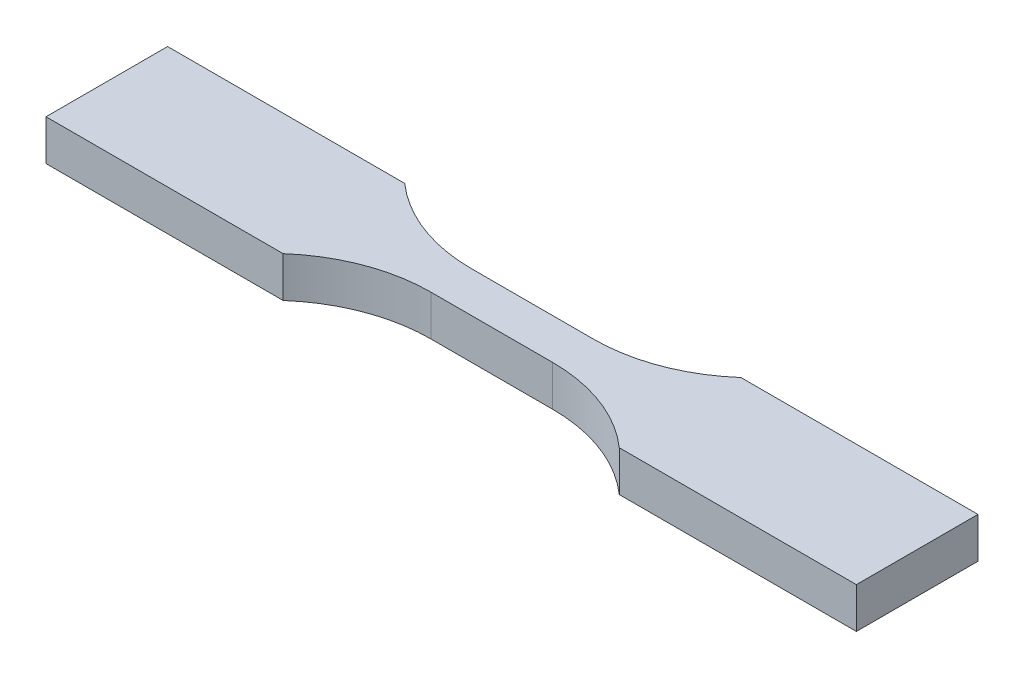
ISO-10303-21;
HEADER;
FILE_DESCRIPTION(('STEP AP214'),'2;1');
FILE_NAME('part.step','',(''),(''),'','','');
FILE_SCHEMA(('AUTOMOTIVE_DESIGN { 1 0 10303 214 1 1 1 1 }'));
ENDSEC;
DATA;
#1=APPLICATION_CONTEXT('core data for automotive mechanical design processes');
#2=APPLICATION_PROTOCOL_DEFINITION('international standard','automotive_design',2000,#1);
#3=PRODUCT_CONTEXT('',#1,'mechanical');
#4=PRODUCT('Part','Part','',(#3));
#5=PRODUCT_RELATED_PRODUCT_CATEGORY('part','',(#4));
#6=PRODUCT_DEFINITION_FORMATION('','',#4);
#7=PRODUCT_DEFINITION_CONTEXT('part definition',#1,'design');
#8=PRODUCT_DEFINITION('design','',#6,#7);
#9=PRODUCT_DEFINITION_SHAPE('','',#8);
#10=(LENGTH_UNIT() NAMED_UNIT(*) SI_UNIT(.MILLI.,.METRE.));
#11=(NAMED_UNIT(*) PLANE_ANGLE_UNIT() SI_UNIT($,.RADIAN.));
#12=(NAMED_UNIT(*) SI_UNIT($,.STERADIAN.) SOLID_ANGLE_UNIT());
#13=UNCERTAINTY_MEASURE_WITH_UNIT(LENGTH_MEASURE(1.E-05),#10,'distance_accuracy_value','');
#14=(GEOMETRIC_REPRESENTATION_CONTEXT(3) GLOBAL_UNCERTAINTY_ASSIGNED_CONTEXT((#13)) GLOBAL_UNIT_ASSIGNED_CONTEXT((#10,
#11,#12)) REPRESENTATION_CONTEXT('',''));
#15=CARTESIAN_POINT('',(0.,0.,0.));
#16=DIRECTION('',(0.,0.,1.));
#17=DIRECTION('',(1.,0.,0.));
#18=AXIS2_PLACEMENT_3D('',#15,#16,#17);
#19=CARTESIAN_POINT('',(-4.77447991768053,3.18,-14.2941784822917));
#20=DIRECTION('',(0.,-1.,0.));
#21=DIRECTION('',(0.,0.,-1.));
#22=AXIS2_PLACEMENT_3D('',#19,#20,#21);
#23=CYLINDRICAL_SURFACE('',#22,12.7);
#24=CARTESIAN_POINT('',(-4.77447991768053,0.,-14.2941784822917));
#25=DIRECTION('',(0.,-1.,0.));
#26=DIRECTION('',(0.,0.,-1.));
#27=AXIS2_PLACEMENT_3D('',#24,#25,#26);
#28=CIRCLE('',#27,12.7);
#29=CARTESIAN_POINT('',(-4.765,0.,-1.59418202043543));
#30=VERTEX_POINT('',#29);
#31=CARTESIAN_POINT('',(-13.17,0.,-4.765));
#32=VERTEX_POINT('',#31);
#33=EDGE_CURVE('E164',#30,#32,#28,.T.);
#34=ORIENTED_EDGE('',*,*,#33,.T.);
#35=DIRECTION('',(0.,-1.,0.));
#36=VECTOR('',#35,1.);
#37=CARTESIAN_POINT('',(-13.17,3.18,-4.765));
#38=LINE('',#37,#36);
#39=CARTESIAN_POINT('',(-13.17,3.18,-4.765));
#40=VERTEX_POINT('',#39);
#41=EDGE_CURVE('E11',#40,#32,#38,.T.);
#42=ORIENTED_EDGE('',*,*,#41,.F.);
#43=CARTESIAN_POINT('',(-4.77447991768053,3.18,-14.2941784822917));
#44=DIRECTION('',(0.,-1.,0.));
#45=DIRECTION('',(0.,0.,-1.));
#46=AXIS2_PLACEMENT_3D('',#43,#44,#45);
#47=CIRCLE('',#46,12.7);
#48=CARTESIAN_POINT('',(-4.765,3.18,-1.59418202043543));
#49=VERTEX_POINT('',#48);
#50=EDGE_CURVE('E198',#49,#40,#47,.T.);
#51=ORIENTED_EDGE('',*,*,#50,.F.);
#52=DIRECTION('',(0.,-1.,0.));
#53=VECTOR('',#52,1.);
#54=CARTESIAN_POINT('',(-4.765,3.18,-1.59418202043543));
#55=LINE('',#54,#53);
#56=EDGE_CURVE('E160',#49,#30,#55,.T.);
#57=ORIENTED_EDGE('',*,*,#56,.T.);
#58=EDGE_LOOP('',(#34,#42,#51,#57));
#59=FACE_BOUND('',#58,.T.);
#60=ADVANCED_FACE('F39',(#59),#23,.F.);
#61=CARTESIAN_POINT('',(-13.17,3.18,-4.765));
#62=DIRECTION('',(0.,0.,1.));
#63=DIRECTION('',(1.,0.,0.));
#64=AXIS2_PLACEMENT_3D('',#61,#62,#63);
#65=PLANE('',#64);
#66=DIRECTION('',(-1.,0.,0.));
#67=VECTOR('',#66,1.);
#68=CARTESIAN_POINT('',(-13.17,0.,-4.765));
#69=LINE('',#68,#67);
#70=CARTESIAN_POINT('',(-31.75,0.,-4.765));
#71=VERTEX_POINT('',#70);
#72=EDGE_CURVE('E168',#32,#71,#69,.T.);
#73=ORIENTED_EDGE('',*,*,#72,.T.);
#74=DIRECTION('',(0.,-1.,0.));
#75=VECTOR('',#74,1.);
#76=CARTESIAN_POINT('',(-31.75,3.18,-4.765));
#77=LINE('',#76,#75);
#78=CARTESIAN_POINT('',(-31.75,3.18,-4.765));
#79=VERTEX_POINT('',#78);
#80=EDGE_CURVE('E48',#79,#71,#77,.T.);
#81=ORIENTED_EDGE('',*,*,#80,.F.);
#82=DIRECTION('',(-1.,0.,0.));
#83=VECTOR('',#82,1.);
#84=CARTESIAN_POINT('',(-13.17,3.18,-4.765));
#85=LINE('',#84,#83);
#86=EDGE_CURVE('E111',#40,#79,#85,.T.);
#87=ORIENTED_EDGE('',*,*,#86,.F.);
#88=ORIENTED_EDGE('',*,*,#41,.T.);
#89=EDGE_LOOP('',(#73,#81,#87,#88));
#90=FACE_BOUND('',#89,.T.);
#91=ADVANCED_FACE('F292',(#90),#65,.F.);
#92=CARTESIAN_POINT('',(-31.75,3.18,-4.765));
#93=DIRECTION('',(1.,0.,0.));
#94=DIRECTION('',(0.,0.,-1.));
#95=AXIS2_PLACEMENT_3D('',#92,#93,#94);
#96=PLANE('',#95);
#97=DIRECTION('',(0.,0.,1.));
#98=VECTOR('',#97,1.);
#99=CARTESIAN_POINT('',(-31.75,0.,-4.765));
#100=LINE('',#99,#98);
#101=CARTESIAN_POINT('',(-31.75,0.,4.765));
#102=VERTEX_POINT('',#101);
#103=EDGE_CURVE('E171',#71,#102,#100,.T.);
#104=ORIENTED_EDGE('',*,*,#103,.T.);
#105=DIRECTION('',(0.,-1.,0.));
#106=VECTOR('',#105,1.);
#107=CARTESIAN_POINT('',(-31.75,3.18,4.765));
#108=LINE('',#107,#106);
#109=CARTESIAN_POINT('',(-31.75,3.18,4.765));
#110=VERTEX_POINT('',#109);
#111=EDGE_CURVE('E225',#110,#102,#108,.T.);
#112=ORIENTED_EDGE('',*,*,#111,.F.);
#113=DIRECTION('',(0.,0.,1.));
#114=VECTOR('',#113,1.);
#115=CARTESIAN_POINT('',(-31.75,3.18,-4.765));
#116=LINE('',#115,#114);
#117=EDGE_CURVE('E235',#79,#110,#116,.T.);
#118=ORIENTED_EDGE('',*,*,#117,.F.);
#119=ORIENTED_EDGE('',*,*,#80,.T.);
#120=EDGE_LOOP('',(#104,#112,#118,#119));
#121=FACE_BOUND('',#120,.T.);
#122=ADVANCED_FACE('F233',(#121),#96,.F.);
#123=CARTESIAN_POINT('',(-31.75,3.18,4.765));
#124=DIRECTION('',(0.,0.,-1.));
#125=DIRECTION('',(-1.,0.,0.));
#126=AXIS2_PLACEMENT_3D('',#123,#124,#125);
#127=PLANE('',#126);
#128=DIRECTION('',(1.,0.,0.));
#129=VECTOR('',#128,1.);
#130=CARTESIAN_POINT('',(-31.75,0.,4.765));
#131=LINE('',#130,#129);
#132=CARTESIAN_POINT('',(-13.17,0.,4.765));
#133=VERTEX_POINT('',#132);
#134=EDGE_CURVE('E174',#102,#133,#131,.T.);
#135=ORIENTED_EDGE('',*,*,#134,.T.);
#136=DIRECTION('',(0.,-1.,0.));
#137=VECTOR('',#136,1.);
#138=CARTESIAN_POINT('',(-13.17,3.18,4.765));
#139=LINE('',#138,#137);
#140=CARTESIAN_POINT('',(-13.17,3.18,4.765));
#141=VERTEX_POINT('',#140);
#142=EDGE_CURVE('E221',#141,#133,#139,.T.);
#143=ORIENTED_EDGE('',*,*,#142,.F.);
#144=DIRECTION('',(1.,0.,0.));
#145=VECTOR('',#144,1.);
#146=CARTESIAN_POINT('',(-31.75,3.18,4.765));
#147=LINE('',#146,#145);
#148=EDGE_CURVE('E254',#110,#141,#147,.T.);
#149=ORIENTED_EDGE('',*,*,#148,.F.);
#150=ORIENTED_EDGE('',*,*,#111,.T.);
#151=EDGE_LOOP('',(#135,#143,#149,#150));
#152=FACE_BOUND('',#151,.T.);
#153=ADVANCED_FACE('F244',(#152),#127,.F.);
#154=CARTESIAN_POINT('',(-4.765,3.18,14.2858179795646));
#155=DIRECTION('',(0.,-1.,0.));
#156=DIRECTION('',(0.,0.,-1.));
#157=AXIS2_PLACEMENT_3D('',#154,#155,#156);
#158=CYLINDRICAL_SURFACE('',#157,12.7);
#159=CARTESIAN_POINT('',(-4.765,0.,14.2858179795646));
#160=DIRECTION('',(0.,-1.,0.));
#161=DIRECTION('',(0.,0.,1.));
#162=AXIS2_PLACEMENT_3D('',#159,#160,#161);
#163=CIRCLE('',#162,12.7);
#164=CARTESIAN_POINT('',(-4.765,0.,1.58581797956457));
#165=VERTEX_POINT('',#164);
#166=EDGE_CURVE('E177',#133,#165,#163,.T.);
#167=ORIENTED_EDGE('',*,*,#166,.T.);
#168=DIRECTION('',(0.,-1.,0.));
#169=VECTOR('',#168,1.);
#170=CARTESIAN_POINT('',(-4.765,3.18,1.58581797956457));
#171=LINE('',#170,#169);
#172=CARTESIAN_POINT('',(-4.765,3.18,1.58581797956457));
#173=VERTEX_POINT('',#172);
#174=EDGE_CURVE('E217',#173,#165,#171,.T.);
#175=ORIENTED_EDGE('',*,*,#174,.F.);
#176=CARTESIAN_POINT('',(-4.765,3.18,14.2858179795646));
#177=DIRECTION('',(0.,-1.,0.));
#178=DIRECTION('',(0.,0.,1.));
#179=AXIS2_PLACEMENT_3D('',#176,#177,#178);
#180=CIRCLE('',#179,12.7);
#181=EDGE_CURVE('E250',#141,#173,#180,.T.);
#182=ORIENTED_EDGE('',*,*,#181,.F.);
#183=ORIENTED_EDGE('',*,*,#142,.T.);
#184=EDGE_LOOP('',(#167,#175,#182,#183));
#185=FACE_BOUND('',#184,.T.);
#186=ADVANCED_FACE('F248',(#185),#158,.F.);
#187=CARTESIAN_POINT('',(-4.765,3.18,1.58581797956457));
#188=DIRECTION('',(0.,0.,-1.));
#189=DIRECTION('',(-1.,0.,0.));
#190=AXIS2_PLACEMENT_3D('',#187,#188,#189);
#191=PLANE('',#190);
#192=DIRECTION('',(1.,0.,0.));
#193=VECTOR('',#192,1.);
#194=CARTESIAN_POINT('',(-4.765,0.,1.58581797956457));
#195=LINE('',#194,#193);
#196=CARTESIAN_POINT('',(4.765,0.,1.58581797956457));
#197=VERTEX_POINT('',#196);
#198=EDGE_CURVE('E180',#165,#197,#195,.T.);
#199=ORIENTED_EDGE('',*,*,#198,.T.);
#200=DIRECTION('',(0.,-1.,0.));
#201=VECTOR('',#200,1.);
#202=CARTESIAN_POINT('',(4.765,3.18,1.58581797956457));
#203=LINE('',#202,#201);
#204=CARTESIAN_POINT('',(4.765,3.18,1.58581797956457));
#205=VERTEX_POINT('',#204);
#206=EDGE_CURVE('E213',#205,#197,#203,.T.);
#207=ORIENTED_EDGE('',*,*,#206,.F.);
#208=DIRECTION('',(1.,0.,0.));
#209=VECTOR('',#208,1.);
#210=CARTESIAN_POINT('',(-4.765,3.18,1.58581797956457));
#211=LINE('',#210,#209);
#212=EDGE_CURVE('E253',#173,#205,#211,.T.);
#213=ORIENTED_EDGE('',*,*,#212,.F.);
#214=ORIENTED_EDGE('',*,*,#174,.T.);
#215=EDGE_LOOP('',(#199,#207,#213,#214));
#216=FACE_BOUND('',#215,.T.);
#217=ADVANCED_FACE('F305',(#216),#191,.F.);
#218=CARTESIAN_POINT('',(4.765,3.18,14.2858179795646));
#219=DIRECTION('',(0.,-1.,0.));
#220=DIRECTION('',(0.,0.,-1.));
#221=AXIS2_PLACEMENT_3D('',#218,#219,#220);
#222=CYLINDRICAL_SURFACE('',#221,12.7);
#223=CARTESIAN_POINT('',(4.765,0.,14.2858179795646));
#224=DIRECTION('',(0.,-1.,0.));
#225=DIRECTION('',(0.,0.,-1.));
#226=AXIS2_PLACEMENT_3D('',#223,#224,#225);
#227=CIRCLE('',#226,12.7);
#228=CARTESIAN_POINT('',(13.17,0.,4.765));
#229=VERTEX_POINT('',#228);
#230=EDGE_CURVE('E183',#197,#229,#227,.T.);
#231=ORIENTED_EDGE('',*,*,#230,.T.);
#232=DIRECTION('',(0.,-1.,0.));
#233=VECTOR('',#232,1.);
#234=CARTESIAN_POINT('',(13.17,3.18,4.765));
#235=LINE('',#234,#233);
#236=CARTESIAN_POINT('',(13.17,3.18,4.765));
#237=VERTEX_POINT('',#236);
#238=EDGE_CURVE('E209',#237,#229,#235,.T.);
#239=ORIENTED_EDGE('',*,*,#238,.F.);
#240=CARTESIAN_POINT('',(4.765,3.18,14.2858179795646));
#241=DIRECTION('',(0.,-1.,0.));
#242=DIRECTION('',(0.,0.,-1.));
#243=AXIS2_PLACEMENT_3D('',#240,#241,#242);
#244=CIRCLE('',#243,12.7);
#245=EDGE_CURVE('E258',#205,#237,#244,.T.);
#246=ORIENTED_EDGE('',*,*,#245,.F.);
#247=ORIENTED_EDGE('',*,*,#206,.T.);
#248=EDGE_LOOP('',(#231,#239,#246,#247));
#249=FACE_BOUND('',#248,.T.);
#250=ADVANCED_FACE('F308',(#249),#222,.F.);
#251=CARTESIAN_POINT('',(31.75,3.18,4.765));
#252=DIRECTION('',(0.,0.,-1.));
#253=DIRECTION('',(-1.,0.,0.));
#254=AXIS2_PLACEMENT_3D('',#251,#252,#253);
#255=PLANE('',#254);
#256=DIRECTION('',(1.,0.,0.));
#257=VECTOR('',#256,1.);
#258=CARTESIAN_POINT('',(31.75,0.,4.765));
#259=LINE('',#258,#257);
#260=CARTESIAN_POINT('',(31.75,0.,4.765));
#261=VERTEX_POINT('',#260);
#262=EDGE_CURVE('E186',#229,#261,#259,.T.);
#263=ORIENTED_EDGE('',*,*,#262,.T.);
#264=DIRECTION('',(0.,-1.,0.));
#265=VECTOR('',#264,1.);
#266=CARTESIAN_POINT('',(31.75,3.18,4.765));
#267=LINE('',#266,#265);
#268=CARTESIAN_POINT('',(31.75,3.18,4.765));
#269=VERTEX_POINT('',#268);
#270=EDGE_CURVE('E205',#269,#261,#267,.T.);
#271=ORIENTED_EDGE('',*,*,#270,.F.);
#272=DIRECTION('',(1.,0.,0.));
#273=VECTOR('',#272,1.);
#274=CARTESIAN_POINT('',(31.75,3.18,4.765));
#275=LINE('',#274,#273);
#276=EDGE_CURVE('E265',#237,#269,#275,.T.);
#277=ORIENTED_EDGE('',*,*,#276,.F.);
#278=ORIENTED_EDGE('',*,*,#238,.T.);
#279=EDGE_LOOP('',(#263,#271,#277,#278));
#280=FACE_BOUND('',#279,.T.);
#281=ADVANCED_FACE('F273',(#280),#255,.F.);
#282=CARTESIAN_POINT('',(31.75,3.18,-4.765));
#283=DIRECTION('',(-1.,0.,0.));
#284=DIRECTION('',(0.,0.,1.));
#285=AXIS2_PLACEMENT_3D('',#282,#283,#284);
#286=PLANE('',#285);
#287=DIRECTION('',(0.,0.,-1.));
#288=VECTOR('',#287,1.);
#289=CARTESIAN_POINT('',(31.75,0.,-4.765));
#290=LINE('',#289,#288);
#291=CARTESIAN_POINT('',(31.75,0.,-4.765));
#292=VERTEX_POINT('',#291);
#293=EDGE_CURVE('E189',#261,#292,#290,.T.);
#294=ORIENTED_EDGE('',*,*,#293,.T.);
#295=DIRECTION('',(0.,-1.,0.));
#296=VECTOR('',#295,1.);
#297=CARTESIAN_POINT('',(31.75,3.18,-4.765));
#298=LINE('',#297,#296);
#299=CARTESIAN_POINT('',(31.75,3.18,-4.765));
#300=VERTEX_POINT('',#299);
#301=EDGE_CURVE('E153',#300,#292,#298,.T.);
#302=ORIENTED_EDGE('',*,*,#301,.F.);
#303=DIRECTION('',(0.,0.,-1.));
#304=VECTOR('',#303,1.);
#305=CARTESIAN_POINT('',(31.75,3.18,-4.765));
#306=LINE('',#305,#304);
#307=EDGE_CURVE('E142',#269,#300,#306,.T.);
#308=ORIENTED_EDGE('',*,*,#307,.F.);
#309=ORIENTED_EDGE('',*,*,#270,.T.);
#310=EDGE_LOOP('',(#294,#302,#308,#309));
#311=FACE_BOUND('',#310,.T.);
#312=ADVANCED_FACE('F277',(#311),#286,.F.);
#313=CARTESIAN_POINT('',(13.17,3.18,-4.765));
#314=DIRECTION('',(0.,0.,1.));
#315=DIRECTION('',(1.,0.,0.));
#316=AXIS2_PLACEMENT_3D('',#313,#314,#315);
#317=PLANE('',#316);
#318=DIRECTION('',(-1.,0.,0.));
#319=VECTOR('',#318,1.);
#320=CARTESIAN_POINT('',(13.17,0.,-4.765));
#321=LINE('',#320,#319);
#322=CARTESIAN_POINT('',(13.17,0.,-4.765));
#323=VERTEX_POINT('',#322);
#324=EDGE_CURVE('E151',#292,#323,#321,.T.);
#325=ORIENTED_EDGE('',*,*,#324,.T.);
#326=DIRECTION('',(0.,-1.,0.));
#327=VECTOR('',#326,1.);
#328=CARTESIAN_POINT('',(13.17,3.18,-4.765));
#329=LINE('',#328,#327);
#330=CARTESIAN_POINT('',(13.17,3.18,-4.765));
#331=VERTEX_POINT('',#330);
#332=EDGE_CURVE('E148',#331,#323,#329,.T.);
#333=ORIENTED_EDGE('',*,*,#332,.F.);
#334=DIRECTION('',(-1.,0.,0.));
#335=VECTOR('',#334,1.);
#336=CARTESIAN_POINT('',(13.17,3.18,-4.765));
#337=LINE('',#336,#335);
#338=EDGE_CURVE('E136',#300,#331,#337,.T.);
#339=ORIENTED_EDGE('',*,*,#338,.F.);
#340=ORIENTED_EDGE('',*,*,#301,.T.);
#341=EDGE_LOOP('',(#325,#333,#339,#340));
#342=FACE_BOUND('',#341,.T.);
#343=ADVANCED_FACE('F149',(#342),#317,.F.);
#344=CARTESIAN_POINT('',(4.77447991768053,3.18,-14.2941784822917));
#345=DIRECTION('',(0.,-1.,0.));
#346=DIRECTION('',(0.,0.,-1.));
#347=AXIS2_PLACEMENT_3D('',#344,#345,#346);
#348=CYLINDRICAL_SURFACE('',#347,12.7);
#349=CARTESIAN_POINT('',(4.77447991768053,0.,-14.2941784822917));
#350=DIRECTION('',(0.,-1.,0.));
#351=DIRECTION('',(0.,0.,1.));
#352=AXIS2_PLACEMENT_3D('',#349,#350,#351);
#353=CIRCLE('',#352,12.7);
#354=CARTESIAN_POINT('',(4.765,0.,-1.59418202043543));
#355=VERTEX_POINT('',#354);
#356=EDGE_CURVE('E97',#323,#355,#353,.T.);
#357=ORIENTED_EDGE('',*,*,#356,.T.);
#358=DIRECTION('',(0.,-1.,0.));
#359=VECTOR('',#358,1.);
#360=CARTESIAN_POINT('',(4.765,3.18,-1.59418202043543));
#361=LINE('',#360,#359);
#362=CARTESIAN_POINT('',(4.765,3.18,-1.59418202043543));
#363=VERTEX_POINT('',#362);
#364=EDGE_CURVE('E154',#363,#355,#361,.T.);
#365=ORIENTED_EDGE('',*,*,#364,.F.);
#366=CARTESIAN_POINT('',(4.77447991768053,3.18,-14.2941784822917));
#367=DIRECTION('',(0.,-1.,0.));
#368=DIRECTION('',(0.,0.,1.));
#369=AXIS2_PLACEMENT_3D('',#366,#367,#368);
#370=CIRCLE('',#369,12.7);
#371=EDGE_CURVE('E140',#331,#363,#370,.T.);
#372=ORIENTED_EDGE('',*,*,#371,.F.);
#373=ORIENTED_EDGE('',*,*,#332,.T.);
#374=EDGE_LOOP('',(#357,#365,#372,#373));
#375=FACE_BOUND('',#374,.T.);
#376=ADVANCED_FACE('F156',(#375),#348,.F.);
#377=CARTESIAN_POINT('',(-4.765,3.18,-1.59418202043543));
#378=DIRECTION('',(0.,0.,1.));
#379=DIRECTION('',(1.,0.,0.));
#380=AXIS2_PLACEMENT_3D('',#377,#378,#379);
#381=PLANE('',#380);
#382=DIRECTION('',(-1.,0.,0.));
#383=VECTOR('',#382,1.);
#384=CARTESIAN_POINT('',(-4.765,0.,-1.59418202043543));
#385=LINE('',#384,#383);
#386=EDGE_CURVE('E103',#355,#30,#385,.T.);
#387=ORIENTED_EDGE('',*,*,#386,.T.);
#388=ORIENTED_EDGE('',*,*,#56,.F.);
#389=DIRECTION('',(-1.,0.,0.));
#390=VECTOR('',#389,1.);
#391=CARTESIAN_POINT('',(-4.765,3.18,-1.59418202043543));
#392=LINE('',#391,#390);
#393=EDGE_CURVE('E56',#363,#49,#392,.T.);
#394=ORIENTED_EDGE('',*,*,#393,.F.);
#395=ORIENTED_EDGE('',*,*,#364,.T.);
#396=EDGE_LOOP('',(#387,#388,#394,#395));
#397=FACE_BOUND('',#396,.T.);
#398=ADVANCED_FACE('F281',(#397),#381,.F.);
#399=CARTESIAN_POINT('',(-4.77447991768053,3.18,-14.2941784822917));
#400=DIRECTION('',(0.,-1.,0.));
#401=DIRECTION('',(0.,0.,-1.));
#402=AXIS2_PLACEMENT_3D('',#399,#400,#401);
#403=PLANE('',#402);
#404=ORIENTED_EDGE('',*,*,#50,.T.);
#405=ORIENTED_EDGE('',*,*,#86,.T.);
#406=ORIENTED_EDGE('',*,*,#117,.T.);
#407=ORIENTED_EDGE('',*,*,#148,.T.);
#408=ORIENTED_EDGE('',*,*,#181,.T.);
#409=ORIENTED_EDGE('',*,*,#212,.T.);
#410=ORIENTED_EDGE('',*,*,#245,.T.);
#411=ORIENTED_EDGE('',*,*,#276,.T.);
#412=ORIENTED_EDGE('',*,*,#307,.T.);
#413=ORIENTED_EDGE('',*,*,#338,.T.);
#414=ORIENTED_EDGE('',*,*,#371,.T.);
#415=ORIENTED_EDGE('',*,*,#393,.T.);
#416=EDGE_LOOP('',(#404,#405,#406,#407,#408,#409,#410,#411,#412,#413,#414,#415));
#417=FACE_BOUND('',#416,.T.);
#418=ADVANCED_FACE('F138',(#417),#403,.F.);
#419=CARTESIAN_POINT('',(-4.77447991768053,0.,-14.2941784822917));
#420=DIRECTION('',(0.,-1.,0.));
#421=DIRECTION('',(0.,0.,-1.));
#422=AXIS2_PLACEMENT_3D('',#419,#420,#421);
#423=PLANE('',#422);
#424=ORIENTED_EDGE('',*,*,#33,.F.);
#425=ORIENTED_EDGE('',*,*,#386,.F.);
#426=ORIENTED_EDGE('',*,*,#356,.F.);
#427=ORIENTED_EDGE('',*,*,#324,.F.);
#428=ORIENTED_EDGE('',*,*,#293,.F.);
#429=ORIENTED_EDGE('',*,*,#262,.F.);
#430=ORIENTED_EDGE('',*,*,#230,.F.);
#431=ORIENTED_EDGE('',*,*,#198,.F.);
#432=ORIENTED_EDGE('',*,*,#166,.F.);
#433=ORIENTED_EDGE('',*,*,#134,.F.);
#434=ORIENTED_EDGE('',*,*,#103,.F.);
#435=ORIENTED_EDGE('',*,*,#72,.F.);
#436=EDGE_LOOP('',(#424,#425,#426,#427,#428,#429,#430,#431,#432,#433,#434,#435));
#437=FACE_BOUND('',#436,.T.);
#438=ADVANCED_FACE('F239',(#437),#423,.T.);
#439=CLOSED_SHELL('',(#60,#91,#122,#153,#186,#217,#250,#281,#312,#343,#376,#398,#418,#438));
#440=MANIFOLD_SOLID_BREP('B2',#439);
#441=ADVANCED_BREP_SHAPE_REPRESENTATION('',(#18,#440),#14);
#442=SHAPE_DEFINITION_REPRESENTATION(#9,#441);
ENDSEC;
END-ISO-10303-21;
